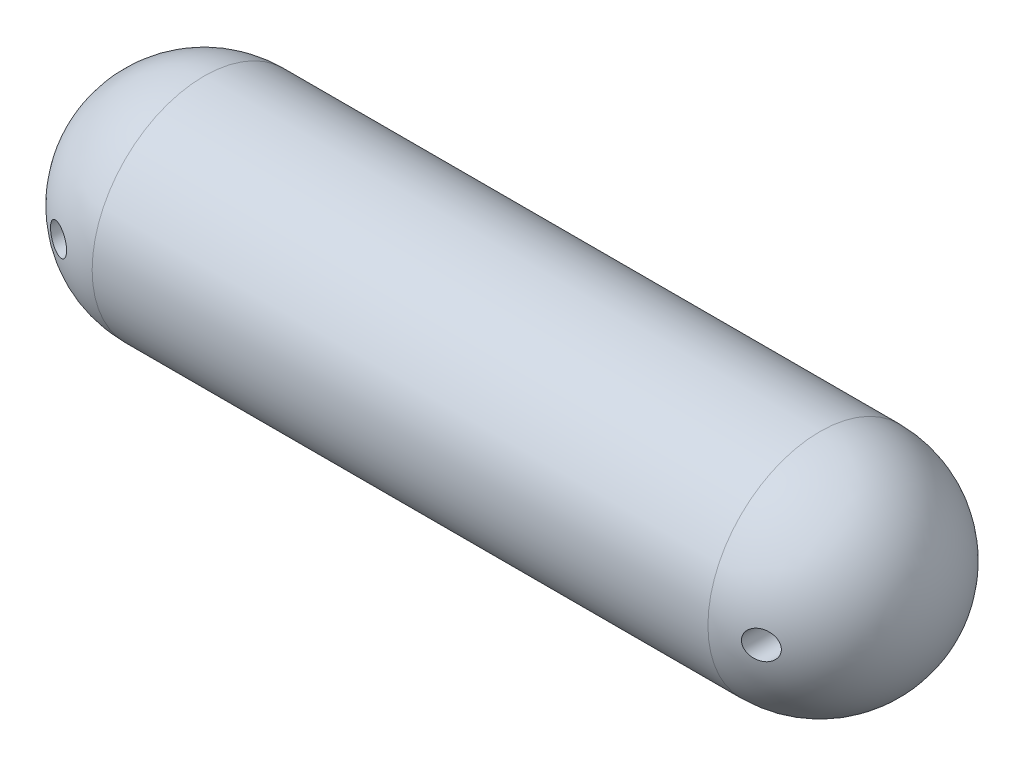
ISO-10303-21;
HEADER;
FILE_DESCRIPTION(('STEP AP214'),'2;1');
FILE_NAME('part.step','',(''),(''),'','','');
FILE_SCHEMA(('AUTOMOTIVE_DESIGN { 1 0 10303 214 1 1 1 1 }'));
ENDSEC;
DATA;
#1=APPLICATION_CONTEXT('core data for automotive mechanical design processes');
#2=APPLICATION_PROTOCOL_DEFINITION('international standard','automotive_design',2000,#1);
#3=PRODUCT_CONTEXT('',#1,'mechanical');
#4=PRODUCT('Part','Part','',(#3));
#5=PRODUCT_RELATED_PRODUCT_CATEGORY('part','',(#4));
#6=PRODUCT_DEFINITION_FORMATION('','',#4);
#7=PRODUCT_DEFINITION_CONTEXT('part definition',#1,'design');
#8=PRODUCT_DEFINITION('design','',#6,#7);
#9=PRODUCT_DEFINITION_SHAPE('','',#8);
#10=(LENGTH_UNIT() NAMED_UNIT(*) SI_UNIT(.MILLI.,.METRE.));
#11=(NAMED_UNIT(*) PLANE_ANGLE_UNIT() SI_UNIT($,.RADIAN.));
#12=(NAMED_UNIT(*) SI_UNIT($,.STERADIAN.) SOLID_ANGLE_UNIT());
#13=UNCERTAINTY_MEASURE_WITH_UNIT(LENGTH_MEASURE(1.E-05),#10,'distance_accuracy_value','');
#14=(GEOMETRIC_REPRESENTATION_CONTEXT(3) GLOBAL_UNCERTAINTY_ASSIGNED_CONTEXT((#13)) GLOBAL_UNIT_ASSIGNED_CONTEXT((#10,
#11,#12)) REPRESENTATION_CONTEXT('',''));
#15=CARTESIAN_POINT('',(0.,0.,0.));
#16=DIRECTION('',(0.,0.,1.));
#17=DIRECTION('',(1.,0.,0.));
#18=AXIS2_PLACEMENT_3D('',#15,#16,#17);
#19=CARTESIAN_POINT('',(17.0807453416149,0.,0.));
#20=DIRECTION('',(-1.,0.,0.));
#21=DIRECTION('',(0.,0.,-1.));
#22=AXIS2_PLACEMENT_3D('',#19,#20,#21);
#23=SPHERICAL_SURFACE('',#22,20.);
#24=CARTESIAN_POINT('',(7.79460655346352,-1.99230699984324,-17.6010891488443));
#25=CARTESIAN_POINT('',(7.91533030538053,-2.08380952371355,-17.6544229268654));
#26=CARTESIAN_POINT('',(8.04365995124297,-2.16376400835696,-17.71087234978));
#27=CARTESIAN_POINT('',(8.31120563862073,-2.29898040794063,-17.8279517079224));
#28=CARTESIAN_POINT('',(8.4504451932171,-2.35418716536529,-17.8885906372037));
#29=CARTESIAN_POINT('',(8.73522617186792,-2.43876323985022,-18.0119551129045));
#30=CARTESIAN_POINT('',(8.88075050281228,-2.46819851307812,-18.0746749038447));
#31=CARTESIAN_POINT('',(9.1744226508665,-2.50096538939297,-18.2005776214291));
#32=CARTESIAN_POINT('',(9.32256938546009,-2.50430752286357,-18.2637603509403));
#33=CARTESIAN_POINT('',(9.6223756258616,-2.48443764411354,-18.3909690205846));
#34=CARTESIAN_POINT('',(9.77399585255528,-2.46037254175409,-18.4549572520982));
#35=CARTESIAN_POINT('',(10.0715001189744,-2.38448121372413,-18.579886983166));
#36=CARTESIAN_POINT('',(10.217383435258,-2.33265149882476,-18.640828098731));
#37=CARTESIAN_POINT('',(10.496211368998,-2.20312770813713,-18.7567762616206));
#38=CARTESIAN_POINT('',(10.629338759897,-2.12590575609882,-18.8118689885273));
#39=CARTESIAN_POINT('',(10.8807794020242,-1.94682111477329,-18.9155172077624));
#40=CARTESIAN_POINT('',(10.999098195504,-1.84496768613979,-18.9640751463095));
#41=CARTESIAN_POINT('',(11.2092453579851,-1.62623933073859,-19.0500419651065));
#42=CARTESIAN_POINT('',(11.3022760519971,-1.51072234174064,-19.0879618282634));
#43=CARTESIAN_POINT('',(11.4672731348825,-1.26326039234458,-19.1550596117576));
#44=CARTESIAN_POINT('',(11.5392511380246,-1.13132454732623,-19.184242352368));
#45=CARTESIAN_POINT('',(11.6541498737888,-0.865942912724311,-19.230755635141));
#46=CARTESIAN_POINT('',(11.6989004676941,-0.733419218899159,-19.2488336366757));
#47=CARTESIAN_POINT('',(11.7657407015413,-0.461887843720156,-19.2758162853889));
#48=CARTESIAN_POINT('',(11.7878393759314,-0.322882770532058,-19.2847245897977));
#49=CARTESIAN_POINT('',(11.8078008301975,-0.0508195176042772,-19.2927715986983));
#50=CARTESIAN_POINT('',(11.806965791017,0.0821293936031812,-19.2924352175527));
#51=CARTESIAN_POINT('',(11.7842972852861,0.345914410315859,-19.2832963621108));
#52=CARTESIAN_POINT('',(11.7624665237958,0.476750785789323,-19.2744949784338));
#53=CARTESIAN_POINT('',(11.6991228223282,0.730885662094999,-19.2489229447746));
#54=CARTESIAN_POINT('',(11.6578717810423,0.854260520298883,-19.232258330428));
#55=CARTESIAN_POINT('',(11.5573536194464,1.09211789740075,-19.1915739543694));
#56=CARTESIAN_POINT('',(11.4980846718743,1.20659951292316,-19.1675534466675));
#57=CARTESIAN_POINT('',(11.361438549868,1.42747149316575,-19.112039271456));
#58=CARTESIAN_POINT('',(11.2835439916699,1.53348720206525,-19.0803316354125));
#59=CARTESIAN_POINT('',(11.1133539344664,1.73094502018716,-19.0108463399338));
#60=CARTESIAN_POINT('',(11.0210548157199,1.82238345455985,-18.9730671546998));
#61=CARTESIAN_POINT('',(10.8185247511426,1.99434562349603,-18.8898851646838));
#62=CARTESIAN_POINT('',(10.7075262747221,2.07380381386169,-18.8441501251574));
#63=CARTESIAN_POINT('',(10.4755893949155,2.21304986785943,-18.7481983986838));
#64=CARTESIAN_POINT('',(10.3546477705175,2.27283132572621,-18.6979802590125));
#65=CARTESIAN_POINT('',(10.0967832023094,2.3755904560324,-18.5904435250398));
#66=CARTESIAN_POINT('',(9.95933964167247,2.41700100264169,-18.5328744445771));
#67=CARTESIAN_POINT('',(9.68034443771659,2.47574523813251,-18.4154430705687));
#68=CARTESIAN_POINT('',(9.53879149449842,2.4930712218545,-18.355580049434));
#69=CARTESIAN_POINT('',(9.24693166321698,2.50383318301577,-18.2315323978607));
#70=CARTESIAN_POINT('',(9.09659133883373,2.49583167453516,-18.1672978468911));
#71=CARTESIAN_POINT('',(8.79939659101112,2.45297937595842,-18.0396447107553));
#72=CARTESIAN_POINT('',(8.65254289472893,2.41812303495821,-17.9762262970406));
#73=CARTESIAN_POINT('',(8.36421829006895,2.32137162631801,-17.85107400715));
#74=CARTESIAN_POINT('',(8.22286730211414,2.25906268885308,-17.7893819206959));
#75=CARTESIAN_POINT('',(7.95252062900798,2.10837586226491,-17.6708153193121));
#76=CARTESIAN_POINT('',(7.82352340351644,2.02000122878754,-17.6139402038767));
#77=CARTESIAN_POINT('',(7.5875531222298,1.82309231595902,-17.5094515269272));
#78=CARTESIAN_POINT('',(7.47989276358602,1.71553591229076,-17.4615533843893));
#79=CARTESIAN_POINT('',(7.28459618626964,1.48055162738279,-17.3743669893714));
#80=CARTESIAN_POINT('',(7.19694795038443,1.35313574945745,-17.3350735703665));
#81=CARTESIAN_POINT('',(7.05221457040599,1.09361522861379,-17.2700239476934));
#82=CARTESIAN_POINT('',(6.9931700677234,0.962820916371059,-17.2434032723883));
#83=CARTESIAN_POINT('',(6.89807294361344,0.691545679589723,-17.2004660031274));
#84=CARTESIAN_POINT('',(6.86200578267497,0.551070943086446,-17.1841428931831));
#85=CARTESIAN_POINT('',(6.81667472863076,0.277174296885228,-17.1636174698269));
#86=CARTESIAN_POINT('',(6.80541994073164,0.144146296361419,-17.1585149386242));
#87=CARTESIAN_POINT('',(6.8042480214304,-0.122000602606263,-17.1579839000721));
#88=CARTESIAN_POINT('',(6.81432427154652,-0.255119460048039,-17.1625523920487));
#89=CARTESIAN_POINT('',(6.85459446404069,-0.512671825142452,-17.1807877722957));
#90=CARTESIAN_POINT('',(6.88405261067243,-0.6372455473732,-17.1941218759786));
#91=CARTESIAN_POINT('',(6.96115286621925,-0.879449724899457,-17.2289545536389));
#92=CARTESIAN_POINT('',(7.00880136066136,-0.997077725211483,-17.2504559946594));
#93=CARTESIAN_POINT('',(7.12202818408189,-1.22563643152107,-17.3014204950242));
#94=CARTESIAN_POINT('',(7.1880627894187,-1.33629465893522,-17.3310859019082));
#95=CARTESIAN_POINT('',(7.33510190030447,-1.5448321790412,-17.3969324759289));
#96=CARTESIAN_POINT('',(7.4160914839686,-1.64272404516502,-17.4331071472949));
#97=CARTESIAN_POINT('',(7.5486869494138,-1.78054247656994,-17.4921193304617));
#98=CARTESIAN_POINT('',(7.59576876269218,-1.8257617268448,-17.5130380782674));
#99=CARTESIAN_POINT('',(7.69297459054838,-1.9121234335518,-17.556145299169));
#100=CARTESIAN_POINT('',(7.74309828083527,-1.95326632333308,-17.5783336369009));
#101=CARTESIAN_POINT('',(7.79460655346352,-1.99230699984324,-17.6010891488443));
#102=B_SPLINE_CURVE_WITH_KNOTS('',3,(#24,#25,#26,#27,#28,#29,#30,#31,#32,#33,#34,#35,#36,#37,
#38,#39,#40,#41,#42,#43,#44,#45,#46,#47,#48,#49,#50,#51,#52,#53,#54,#55,#56,#57,#58,#59,#60,#61,
#62,#63,#64,#65,#66,#67,#68,#69,#70,#71,#72,#73,#74,#75,#76,#77,#78,#79,#80,#81,#82,#83,#84,#85,
#86,#87,#88,#89,#90,#91,#92,#93,#94,#95,#96,#97,#98,#99,#100,#101),.UNSPECIFIED.,.T.,.F.,(4,2,2,
2,2,2,2,2,2,2,2,2,2,2,2,2,2,2,2,2,2,2,2,2,2,2,2,2,2,2,2,2,2,2,2,2,2,2,4),(0.,0.481528440133662,
0.964124834563134,1.44548249389428,1.92664588212467,2.42320533275707,2.91982720155483,
3.40769316920355,3.89537599910971,4.35220665130577,4.80878480348332,5.22971634401624,
5.65047993562234,6.04740461564583,6.4442781632882,6.83594648002709,7.22765453054894,
7.63185927091083,8.03616574845325,8.46621309018428,8.89640029578224,9.3583589883123,
9.82046543718304,10.3092595118775,10.798154647608,11.2946868777165,11.7911571164233,
12.2672218685106,12.742999989011,13.1784960161067,13.6137161973223,14.0125055858677,
14.4111712582844,14.7955136577669,15.1799911007847,15.5750225917173,15.9696620345329,
16.1751339289771,16.3805839566544),.UNSPECIFIED.);
#103=CARTESIAN_POINT('',(7.79460655346352,-1.99230699984324,-17.6010891488443));
#104=VERTEX_POINT('',#103);
#105=EDGE_CURVE('E174',#104,#104,#102,.T.);
#106=ORIENTED_EDGE('',*,*,#105,.T.);
#107=EDGE_LOOP('',(#106));
#108=FACE_BOUND('',#107,.T.);
#109=CARTESIAN_POINT('',(7.30098081316444,-1.49488151866139,17.3816436223168));
#110=CARTESIAN_POINT('',(7.22337638050521,-1.39085164603845,17.3469261996354));
#111=CARTESIAN_POINT('',(7.15333496113271,-1.28002352921363,17.3154878532966));
#112=CARTESIAN_POINT('',(7.030881783956,-1.04716696434497,17.2604099727311));
#113=CARTESIAN_POINT('',(6.97847484564353,-0.925135466004293,17.2367725705309));
#114=CARTESIAN_POINT('',(6.89332840138515,-0.6727076784167,17.1983182687378));
#115=CARTESIAN_POINT('',(6.86063584336044,-0.542292233735111,17.1835224252267));
#116=CARTESIAN_POINT('',(6.8165962100099,-0.277195292874665,17.1635820916353));
#117=CARTESIAN_POINT('',(6.80524365347801,-0.142514901192461,17.1584351232302));
#118=CARTESIAN_POINT('',(6.80441584472076,0.121730097413196,17.1580598795865));
#119=CARTESIAN_POINT('',(6.81411678860817,0.251292442745063,17.1624581095629));
#120=CARTESIAN_POINT('',(6.85329802682881,0.506743567225778,17.180201015894));
#121=CARTESIAN_POINT('',(6.88277763127659,0.632632474345409,17.1935453802049));
#122=CARTESIAN_POINT('',(6.96014546895818,0.876874441109376,17.2284998878819));
#123=CARTESIAN_POINT('',(7.00796834079723,0.995252537745325,17.2500806815593));
#124=CARTESIAN_POINT('',(7.1202191925147,1.22212716210493,17.3006066082174));
#125=CARTESIAN_POINT('',(7.18465018535646,1.33062189199842,17.3295530774304));
#126=CARTESIAN_POINT('',(7.33175848351165,1.54090615232874,17.3954397272747));
#127=CARTESIAN_POINT('',(7.41521966072911,1.64203903957006,17.4327213165348));
#128=CARTESIAN_POINT('',(7.59549633102399,1.82896913189478,17.5129498175123));
#129=CARTESIAN_POINT('',(7.69231629090874,1.91476118530485,17.5558986239798));
#130=CARTESIAN_POINT('',(7.9051446444597,2.07610546601014,17.649923458263));
#131=CARTESIAN_POINT('',(8.02207882463823,2.15021567096047,17.7013782156689));
#132=CARTESIAN_POINT('',(8.26522435704873,2.27774657209871,17.8078680668331));
#133=CARTESIAN_POINT('',(8.39143913281263,2.33115958725302,17.8629044809644));
#134=CARTESIAN_POINT('',(8.66017710259393,2.41991822162986,17.9795227146427));
#135=CARTESIAN_POINT('',(8.80320292298286,2.4535177851443,18.0412793094795));
#136=CARTESIAN_POINT('',(9.0926035490298,2.49526709567858,18.165585306998));
#137=CARTESIAN_POINT('',(9.23897930632218,2.50340951824111,18.2281349326518));
#138=CARTESIAN_POINT('',(9.53739489369429,2.49381263058465,18.3550033225205));
#139=CARTESIAN_POINT('',(9.68941623293872,2.47497927939469,18.419287013175));
#140=CARTESIAN_POINT('',(9.98856686013777,2.40954710428054,18.5451473785362));
#141=CARTESIAN_POINT('',(10.1356959326981,2.36294705956261,18.6067239340927));
#142=CARTESIAN_POINT('',(10.418651843667,2.24335660560506,18.72459847371));
#143=CARTESIAN_POINT('',(10.5545967243175,2.1707024658953,18.7809526975629));
#144=CARTESIAN_POINT('',(10.8124608643019,2.00021254192434,18.8874153295736));
#145=CARTESIAN_POINT('',(10.9343847373159,1.90238507557107,18.9375257927268));
#146=CARTESIAN_POINT('',(11.1525863475973,1.69040071202999,19.0269044207193));
#147=CARTESIAN_POINT('',(11.2499643635464,1.57757687243561,19.066642917146));
#148=CARTESIAN_POINT('',(11.4240467368156,1.33459005932963,19.1375073379399));
#149=CARTESIAN_POINT('',(11.5007624123647,1.20443663708905,19.1686379776904));
#150=CARTESIAN_POINT('',(11.6249351703399,0.941529693227247,19.2189412744377));
#151=CARTESIAN_POINT('',(11.6742129216984,0.809777790947097,19.2388594061452));
#152=CARTESIAN_POINT('',(11.7500823635764,0.538885070796779,19.2694999927326));
#153=CARTESIAN_POINT('',(11.7766836704414,0.399747411604279,19.2802263455582));
#154=CARTESIAN_POINT('',(11.8051150743385,0.127033191317399,19.2916894865719));
#155=CARTESIAN_POINT('',(11.8083342575241,-0.00637687308146695,19.292986460412));
#156=CARTESIAN_POINT('',(11.7935400318278,-0.27180710560012,19.2870228106977));
#157=CARTESIAN_POINT('',(11.7755298666301,-0.403827482944326,19.2797634944799));
#158=CARTESIAN_POINT('',(11.7195270319749,-0.660362773938304,19.257162883824));
#159=CARTESIAN_POINT('',(11.68189096565,-0.784968796393492,19.241965810795));
#160=CARTESIAN_POINT('',(11.5882937768465,-1.02586698074396,19.2041045830771));
#161=CARTESIAN_POINT('',(11.5323311500532,-1.1421584591944,19.1814398154102));
#162=CARTESIAN_POINT('',(11.4022508124355,-1.36676713177667,19.1286349206801));
#163=CARTESIAN_POINT('',(11.3276676453226,-1.47476891923884,19.0983028442663));
#164=CARTESIAN_POINT('',(11.1637314158488,-1.67670421868553,19.0314385477027));
#165=CARTESIAN_POINT('',(11.0743747809454,-1.77063431733463,18.9949048278048));
#166=CARTESIAN_POINT('',(10.8776928431155,-1.94798082659466,18.9142227968165));
#167=CARTESIAN_POINT('',(10.769600440794,-2.03039539268423,18.8697443700677));
#168=CARTESIAN_POINT('',(10.5430063659978,-2.17601120826471,18.7761362366562));
#169=CARTESIAN_POINT('',(10.4245013307583,-2.23920622117894,18.7270050269736));
#170=CARTESIAN_POINT('',(10.1711506494182,-2.34945031909188,18.6215205267051));
#171=CARTESIAN_POINT('',(10.0357447153831,-2.39495889697062,18.5649018439734));
#172=CARTESIAN_POINT('',(9.7602090289254,-2.46226352871077,18.449132504975));
#173=CARTESIAN_POINT('',(9.62007793036234,-2.48405276536986,18.3899811258574));
#174=CARTESIAN_POINT('',(9.33009850522798,-2.50434299401587,18.266967883095));
#175=CARTESIAN_POINT('',(9.18017399509375,-2.50135962621625,18.2030371366029));
#176=CARTESIAN_POINT('',(8.88298550429385,-2.46868887549645,18.0756391209391));
#177=CARTESIAN_POINT('',(8.73572276838454,-2.43898931253636,18.0121720764775));
#178=CARTESIAN_POINT('',(8.44495870416426,-2.35247683350933,17.8862120441134));
#179=CARTESIAN_POINT('',(8.30160091324699,-2.29510866247768,17.8237673558273));
#180=CARTESIAN_POINT('',(8.02653620673347,-2.15403068232008,17.7033583374721));
#181=CARTESIAN_POINT('',(7.89481529788907,-2.07035307793148,17.6453886371603));
#182=CARTESIAN_POINT('',(7.68354796326669,-1.90627011838663,17.5519994487744));
#183=CARTESIAN_POINT('',(7.59995143867895,-1.83195827629053,17.5149169183388));
#184=CARTESIAN_POINT('',(7.44263360166829,-1.67179247240043,17.4449340213938));
#185=CARTESIAN_POINT('',(7.36890984599281,-1.58594137684714,17.4120326202674));
#186=CARTESIAN_POINT('',(7.30098081316444,-1.49488151866139,17.3816436223168));
#187=B_SPLINE_CURVE_WITH_KNOTS('',3,(#109,#110,#111,#112,#113,#114,#115,#116,#117,#118,#119,
#120,#121,#122,#123,#124,#125,#126,#127,#128,#129,#130,#131,#132,#133,#134,#135,#136,#137,#138,
#139,#140,#141,#142,#143,#144,#145,#146,#147,#148,#149,#150,#151,#152,#153,#154,#155,#156,#157,
#158,#159,#160,#161,#162,#163,#164,#165,#166,#167,#168,#169,#170,#171,#172,#173,#174,#175,#176,
#177,#178,#179,#180,#181,#182,#183,#184,#185,#186),.UNSPECIFIED.,.T.,.F.,(4,2,2,2,2,2,2,2,2,2,2,
2,2,2,2,2,2,2,2,2,2,2,2,2,2,2,2,2,2,2,2,2,2,2,2,2,2,2,4),(0.,0.402668922940206,
0.805447805811281,1.20918211882158,1.61281271799193,2.00093515076473,2.3890440464178,
2.77578267599231,3.16259151521956,3.56982690050626,3.97719878552875,4.41840076043136,
4.85976631546152,5.33575605211753,5.81188272661042,6.30787488872714,6.80388885930315,
7.29371869979265,7.78338689540203,8.24365558766866,8.70367164299418,9.12766693509892,
9.55148233496505,9.94989673157047,10.348250261352,10.7396056721212,11.1309932149063,
11.5333653748035,11.9358349796528,12.3630562024092,12.790415907163,13.2493944068365,
13.7085047872321,14.1953145990049,14.6823464622212,15.1795866402452,15.6762205128682,
16.028773748807,16.3812395751533),.UNSPECIFIED.);
#188=CARTESIAN_POINT('',(7.30098081316444,-1.49488151866139,17.3816436223168));
#189=VERTEX_POINT('',#188);
#190=EDGE_CURVE('E228',#189,#189,#187,.T.);
#191=ORIENTED_EDGE('',*,*,#190,.T.);
#192=EDGE_LOOP('',(#191));
#193=FACE_BOUND('',#192,.T.);
#194=CARTESIAN_POINT('',(17.0807453416149,0.,0.));
#195=DIRECTION('',(-1.,0.,0.));
#196=DIRECTION('',(0.,0.,1.));
#197=AXIS2_PLACEMENT_3D('',#194,#195,#196);
#198=CIRCLE('',#197,20.);
#199=CARTESIAN_POINT('',(17.0807453416149,0.,20.));
#200=VERTEX_POINT('',#199);
#201=EDGE_CURVE('E182',#200,#200,#198,.T.);
#202=ORIENTED_EDGE('',*,*,#201,.T.);
#203=EDGE_LOOP('',(#202));
#204=FACE_BOUND('',#203,.T.);
#205=ADVANCED_FACE('F170',(#108,#193,#204),#23,.T.);
#206=CARTESIAN_POINT('',(127.080745341615,0.,0.));
#207=DIRECTION('',(-1.,0.,0.));
#208=DIRECTION('',(0.,0.,1.));
#209=AXIS2_PLACEMENT_3D('',#206,#207,#208);
#210=SPHERICAL_SURFACE('',#209,20.);
#211=CARTESIAN_POINT('',(132.747377249799,-1.34195258750373,-19.1334379051062));
#212=CARTESIAN_POINT('',(132.82454114132,-1.46322538329317,-19.10207804459));
#213=CARTESIAN_POINT('',(132.911796358442,-1.57719211578266,-19.0665400237634));
#214=CARTESIAN_POINT('',(133.103058603836,-1.787483600649,-18.9883770418997));
#215=CARTESIAN_POINT('',(133.207101466467,-1.88376965089503,-18.9457369145123));
#216=CARTESIAN_POINT('',(133.427866815121,-2.05621635233035,-18.8549094727036));
#217=CARTESIAN_POINT('',(133.544541346876,-2.13244959388852,-18.8067430989289));
#218=CARTESIAN_POINT('',(133.787324302197,-2.26396633223115,-18.7060913750704));
#219=CARTESIAN_POINT('',(133.913429680167,-2.31925655766672,-18.6536074187633));
#220=CARTESIAN_POINT('',(134.179387074744,-2.41084865352808,-18.5424183332547));
#221=CARTESIAN_POINT('',(134.31961150373,-2.445845508529,-18.4835288649152));
#222=CARTESIAN_POINT('',(134.603210753147,-2.4912635868489,-18.3638325601233));
#223=CARTESIAN_POINT('',(134.746586787546,-2.50167516658637,-18.3030249807653));
#224=CARTESIAN_POINT('',(135.040555885803,-2.49778629265615,-18.1777158783643));
#225=CARTESIAN_POINT('',(135.191122889896,-2.48212826708386,-18.1131913970012));
#226=CARTESIAN_POINT('',(135.487559149776,-2.42380264207703,-17.9854821466658));
#227=CARTESIAN_POINT('',(135.633427592667,-2.3811303950237,-17.9222976101558));
#228=CARTESIAN_POINT('',(135.917367707407,-2.26901389553082,-17.7986800453934));
#229=CARTESIAN_POINT('',(136.055367720054,-2.19935832825457,-17.7382730542448));
#230=CARTESIAN_POINT('',(136.317764982523,-2.03450777652873,-17.6228704903209));
#231=CARTESIAN_POINT('',(136.442164896422,-1.93931780658823,-17.5678738579411));
#232=CARTESIAN_POINT('',(136.666985647747,-1.73065249136814,-17.4680729420779));
#233=CARTESIAN_POINT('',(136.768281540171,-1.61829879045308,-17.4229017838568));
#234=CARTESIAN_POINT('',(136.950085215649,-1.37501718627345,-17.341572293216));
#235=CARTESIAN_POINT('',(137.030606383894,-1.24410132733013,-17.3054081580793));
#236=CARTESIAN_POINT('',(137.160980251379,-0.979789065097573,-17.2467228066942));
#237=CARTESIAN_POINT('',(137.212904122356,-0.847618438530103,-17.2232828764681));
#238=CARTESIAN_POINT('',(137.293778949529,-0.575082311919494,-17.186731210031));
#239=CARTESIAN_POINT('',(137.322743600707,-0.434721750833159,-17.173613316846));
#240=CARTESIAN_POINT('',(137.354915494278,-0.161838765864784,-17.1590398796037));
#241=CARTESIAN_POINT('',(137.359983311393,-0.0295775400951261,-17.156741932315));
#242=CARTESIAN_POINT('',(137.349202765233,0.233896565596979,-17.1616273158471));
#243=CARTESIAN_POINT('',(137.333358659785,0.365109653456317,-17.1688087166009));
#244=CARTESIAN_POINT('',(137.282175419532,0.619128719058481,-17.191974099871));
#245=CARTESIAN_POINT('',(137.247372224126,0.742065904812129,-17.2077160701418));
#246=CARTESIAN_POINT('',(137.160043798758,0.980101632433345,-17.2471333149682));
#247=CARTESIAN_POINT('',(137.107516676766,1.0951993358588,-17.270809436493));
#248=CARTESIAN_POINT('',(136.984520057915,1.31876644439829,-17.3260997211906));
#249=CARTESIAN_POINT('',(136.913487733468,1.42686369747086,-17.3579623560334));
#250=CARTESIAN_POINT('',(136.756877711955,1.62962567394311,-17.4279784571104));
#251=CARTESIAN_POINT('',(136.671295715218,1.7242864114112,-17.4661337828397));
#252=CARTESIAN_POINT('',(136.481100793385,1.90519519924525,-17.550611641924));
#253=CARTESIAN_POINT('',(136.375534827184,1.99025328103412,-17.5973348956779));
#254=CARTESIAN_POINT('',(136.153526122935,2.14155527591797,-17.6951645986582));
#255=CARTESIAN_POINT('',(136.037079373391,2.20779221343212,-17.7462726638911));
#256=CARTESIAN_POINT('',(135.786116499719,2.32527811632699,-17.855912459236));
#257=CARTESIAN_POINT('',(135.650904370129,2.37479771273748,-17.9147070239995));
#258=CARTESIAN_POINT('',(135.374771846252,2.44991290865048,-18.034165193889));
#259=CARTESIAN_POINT('',(135.233849564612,2.47550052959658,-18.0948294153725));
#260=CARTESIAN_POINT('',(134.94161375922,2.50310665442555,-18.2199916541868));
#261=CARTESIAN_POINT('',(134.790169854991,2.50367992752321,-18.2845089003186));
#262=CARTESIAN_POINT('',(134.489035096291,2.47743513542738,-18.412128657433));
#263=CARTESIAN_POINT('',(134.339344507295,2.45061297507858,-18.4752309554635));
#264=CARTESIAN_POINT('',(134.044995891833,2.36952203748553,-18.5987065987066));
#265=CARTESIAN_POINT('',(133.900382309535,2.31505534421275,-18.6590567966809));
#266=CARTESIAN_POINT('',(133.622047069852,2.17936478528067,-18.7746914110555));
#267=CARTESIAN_POINT('',(133.488323309184,2.09814610191438,-18.8299768059409));
#268=CARTESIAN_POINT('',(133.242442549391,1.91485383895062,-18.9312362177923));
#269=CARTESIAN_POINT('',(133.129579996622,1.81390063581226,-18.9775199524196));
#270=CARTESIAN_POINT('',(132.922672512064,1.59142960575524,-19.0621108192207));
#271=CARTESIAN_POINT('',(132.828618037637,1.46992226543476,-19.1004219968273));
#272=CARTESIAN_POINT('',(132.669790259578,1.21974255971982,-19.1649689363536));
#273=CARTESIAN_POINT('',(132.603333457826,1.09231893908798,-19.1919017235339));
#274=CARTESIAN_POINT('',(132.492909849431,0.826589835236765,-19.2365899764401));
#275=CARTESIAN_POINT('',(132.448930730577,0.688290357305246,-19.254350466372));
#276=CARTESIAN_POINT('',(132.387725952145,0.415268570831529,-19.2790518074615));
#277=CARTESIAN_POINT('',(132.368837345046,0.280977911812405,-19.2866653143561));
#278=CARTESIAN_POINT('',(132.353049837654,0.0108691137319333,-19.2930294889248));
#279=CARTESIAN_POINT('',(132.356152031486,-0.124949100995284,-19.2917797156181));
#280=CARTESIAN_POINT('',(132.383733717221,-0.38939378054652,-19.2806590001655));
#281=CARTESIAN_POINT('',(132.407495490916,-0.518108914142576,-19.2710775024029));
#282=CARTESIAN_POINT('',(132.474468086582,-0.769363437135631,-19.2440348038335));
#283=CARTESIAN_POINT('',(132.517651857671,-0.891911153419295,-19.2265845624938));
#284=CARTESIAN_POINT('',(132.595194184659,-1.06755961998291,-19.1951890378081));
#285=CARTESIAN_POINT('',(132.622836659263,-1.12422755839437,-19.1839888821248));
#286=CARTESIAN_POINT('',(132.682142057768,-1.23504200886483,-19.1599352985343));
#287=CARTESIAN_POINT('',(132.713804522137,-1.28918880815488,-19.1470820595921));
#288=CARTESIAN_POINT('',(132.747377249799,-1.34195258750373,-19.1334379051062));
#289=B_SPLINE_CURVE_WITH_KNOTS('',3,(#211,#212,#213,#214,#215,#216,#217,#218,#219,#220,#221,
#222,#223,#224,#225,#226,#227,#228,#229,#230,#231,#232,#233,#234,#235,#236,#237,#238,#239,#240,
#241,#242,#243,#244,#245,#246,#247,#248,#249,#250,#251,#252,#253,#254,#255,#256,#257,#258,#259,
#260,#261,#262,#263,#264,#265,#266,#267,#268,#269,#270,#271,#272,#273,#274,#275,#276,#277,#278,
#279,#280,#281,#282,#283,#284,#285,#286,#287,#288),.UNSPECIFIED.,.T.,.F.,(4,2,2,2,2,2,2,2,2,2,2,
2,2,2,2,2,2,2,2,2,2,2,2,2,2,2,2,2,2,2,2,2,2,2,2,2,2,2,4),(0.,0.441112074328708,
0.883178500932246,1.32362192860038,1.76392372867596,2.2300692745537,2.69639763580897,
3.18777707238443,3.67924107053671,4.17463432834087,4.66993037072577,5.14100876459025,
5.61178287957185,6.04124566609471,6.47045208850027,6.86561927531061,7.26070601550094,
7.64516379318645,8.02966262473979,8.42759709311681,8.82564936282665,9.2540206639671,
9.68255052362154,10.1471262919635,10.6118568876463,11.1034042631383,11.5950251274291,
12.0902163824113,12.5853117672018,13.05782186329,13.5300916106433,13.966425093801,
14.4025193173025,14.8079661209657,15.2134330972451,15.605352671886,15.996728064857,
16.1886705240102,16.3805910615593),.UNSPECIFIED.);
#290=CARTESIAN_POINT('',(132.747377249799,-1.34195258750373,-19.1334379051062));
#291=VERTEX_POINT('',#290);
#292=EDGE_CURVE('E196',#291,#291,#289,.T.);
#293=ORIENTED_EDGE('',*,*,#292,.T.);
#294=EDGE_LOOP('',(#293));
#295=FACE_BOUND('',#294,.T.);
#296=CARTESIAN_POINT('',(132.911958594124,-1.57100411723496,19.0664337970597));
#297=CARTESIAN_POINT('',(132.829215287364,-1.46857214241968,19.1001793666177));
#298=CARTESIAN_POINT('',(132.754033855284,-1.35891006934775,19.1307512591204));
#299=CARTESIAN_POINT('',(132.621441167181,-1.12760007507861,19.1845697318763));
#300=CARTESIAN_POINT('',(132.564037629517,-1.00594697805121,19.2078131305071));
#301=CARTESIAN_POINT('',(132.469155196448,-0.753601928584014,19.2461864041341));
#302=CARTESIAN_POINT('',(132.431713442276,-0.62289363471802,19.261301155284));
#303=CARTESIAN_POINT('',(132.378498681188,-0.35645150877349,19.2827725117601));
#304=CARTESIAN_POINT('',(132.36272058523,-0.220718864669313,19.2891311739935));
#305=CARTESIAN_POINT('',(132.35365123957,0.0472146610049497,19.2927868630794));
#306=CARTESIAN_POINT('',(132.359650627793,0.179388132353169,19.2903697445622));
#307=CARTESIAN_POINT('',(132.392313906267,0.440717303446539,19.2771986637733));
#308=CARTESIAN_POINT('',(132.418976538242,0.569873186452885,19.2664452091386));
#309=CARTESIAN_POINT('',(132.491638921514,0.820674238576298,19.2370961241363));
#310=CARTESIAN_POINT('',(132.537502820539,0.942365418306503,19.2185555858216));
#311=CARTESIAN_POINT('',(132.646841075111,1.17612247758521,19.1742655676672));
#312=CARTESIAN_POINT('',(132.710317537655,1.28818720341541,19.1485152253125));
#313=CARTESIAN_POINT('',(132.855337486759,1.50404219547029,19.0895353717958));
#314=CARTESIAN_POINT('',(132.937458108091,1.60737837815343,19.0560662369281));
#315=CARTESIAN_POINT('',(133.115614017134,1.79883282625509,18.9832294461219));
#316=CARTESIAN_POINT('',(133.21165298114,1.88694705753131,18.9438602316831));
#317=CARTESIAN_POINT('',(133.42159196965,2.05170101424093,18.8574952522223));
#318=CARTESIAN_POINT('',(133.536253370906,2.12719560333807,18.8101672086637));
#319=CARTESIAN_POINT('',(133.774893441181,2.25793381951832,18.7112557875012));
#320=CARTESIAN_POINT('',(133.898875165917,2.31317076983012,18.6596710137598));
#321=CARTESIAN_POINT('',(134.162288879434,2.40597502684462,18.5495866299929));
#322=CARTESIAN_POINT('',(134.302187064285,2.44194878141592,18.4908573618059));
#323=CARTESIAN_POINT('',(134.585267757346,2.48936712856844,18.3714282917676));
#324=CARTESIAN_POINT('',(134.728451279674,2.50080404130715,18.3107278789959));
#325=CARTESIAN_POINT('',(135.022213759358,2.49906268255906,18.185560215277));
#326=CARTESIAN_POINT('',(135.172775018157,2.4845233519854,18.1210663946753));
#327=CARTESIAN_POINT('',(135.46937813114,2.42845413962402,17.9933409360808));
#328=CARTESIAN_POINT('',(135.615419162456,2.38691937347887,17.9301095286342));
#329=CARTESIAN_POINT('',(135.900059212312,2.27702531180086,17.8062407792209));
#330=CARTESIAN_POINT('',(136.038578147155,2.20842466183204,17.7456323787157));
#331=CARTESIAN_POINT('',(136.302193331249,2.04559952553483,17.6297408065242));
#332=CARTESIAN_POINT('',(136.427292024846,1.95137971653526,17.5744566652724));
#333=CARTESIAN_POINT('',(136.653782282384,1.74437094559381,17.4739504892535));
#334=CARTESIAN_POINT('',(136.756021010667,1.6326843830122,17.4283738849619));
#335=CARTESIAN_POINT('',(136.93981453478,1.39054370460579,17.3461780581285));
#336=CARTESIAN_POINT('',(137.021382572032,1.26010168770298,17.3095531017942));
#337=CARTESIAN_POINT('',(137.15384886941,0.996423129043633,17.2499385336997));
#338=CARTESIAN_POINT('',(137.206803997176,0.864426320724264,17.2260372230919));
#339=CARTESIAN_POINT('',(137.289732748198,0.59202267274167,17.1885622685504));
#340=CARTESIAN_POINT('',(137.319720208866,0.451620951880901,17.1749824062552));
#341=CARTESIAN_POINT('',(137.353783910818,0.178555998625682,17.1595528436796));
#342=CARTESIAN_POINT('',(137.359741359683,0.0461724184486616,17.1568515375428));
#343=CARTESIAN_POINT('',(137.350677720291,-0.217709614724009,17.1609589525664));
#344=CARTESIAN_POINT('',(137.335661063661,-0.34920824880198,17.1677656647737));
#345=CARTESIAN_POINT('',(137.286048381531,-0.603757058040745,17.1902220349935));
#346=CARTESIAN_POINT('',(137.252016679692,-0.726940919057855,17.2056167989203));
#347=CARTESIAN_POINT('',(137.166165573357,-0.96559285965666,17.2443726943923));
#348=CARTESIAN_POINT('',(137.114344375113,-1.0810601597602,17.2677346292805));
#349=CARTESIAN_POINT('',(136.992768544629,-1.30535449024206,17.322396873854));
#350=CARTESIAN_POINT('',(136.922466872082,-1.41382507208638,17.3539388519145));
#351=CARTESIAN_POINT('',(136.767250715047,-1.617445256762,17.4233490556267));
#352=CARTESIAN_POINT('',(136.682331930806,-1.71259092497293,17.461219142652));
#353=CARTESIAN_POINT('',(136.493482800922,-1.89455681419954,17.5451240752208));
#354=CARTESIAN_POINT('',(136.388600327546,-1.98020312126,17.5915598124228));
#355=CARTESIAN_POINT('',(136.167871269512,-2.13279218297687,17.6888589326013));
#356=CARTESIAN_POINT('',(136.052020620656,-2.19972796795213,17.7397239562613));
#357=CARTESIAN_POINT('',(135.802173459971,-2.3187854985714,17.8489178439412));
#358=CARTESIAN_POINT('',(135.667470586817,-2.36918192646522,17.9075144031184));
#359=CARTESIAN_POINT('',(135.392233093354,-2.44614415718433,18.0266341499849));
#360=CARTESIAN_POINT('',(135.25169674802,-2.47270285762948,18.0871579063186));
#361=CARTESIAN_POINT('',(134.960004783061,-2.50240784555211,18.2121407878249));
#362=CARTESIAN_POINT('',(134.808708530642,-2.50409523874577,18.2766231968906));
#363=CARTESIAN_POINT('',(134.507651734343,-2.48011876855208,18.404264724479));
#364=CARTESIAN_POINT('',(134.35789182641,-2.45444400638563,18.467423305479));
#365=CARTESIAN_POINT('',(134.062980390775,-2.37561509419339,18.5911866198301));
#366=CARTESIAN_POINT('',(133.917881746105,-2.32221838915158,18.6517636181292));
#367=CARTESIAN_POINT('',(133.638529713723,-2.1886088730427,18.7678640518393));
#368=CARTESIAN_POINT('',(133.504261511442,-2.10843349119589,18.8233944040217));
#369=CARTESIAN_POINT('',(133.291936622972,-1.95268018998886,18.9108643604927));
#370=CARTESIAN_POINT('',(133.209639746897,-1.88383857573139,18.9446673266989));
#371=CARTESIAN_POINT('',(133.05382890776,-1.73530950436715,19.0085129929487));
#372=CARTESIAN_POINT('',(132.980313438306,-1.65562391250271,19.038556337972));
#373=CARTESIAN_POINT('',(132.911958594124,-1.57100411723496,19.0664337970597));
#374=B_SPLINE_CURVE_WITH_KNOTS('',3,(#296,#297,#298,#299,#300,#301,#302,#303,#304,#305,#306,
#307,#308,#309,#310,#311,#312,#313,#314,#315,#316,#317,#318,#319,#320,#321,#322,#323,#324,#325,
#326,#327,#328,#329,#330,#331,#332,#333,#334,#335,#336,#337,#338,#339,#340,#341,#342,#343,#344,
#345,#346,#347,#348,#349,#350,#351,#352,#353,#354,#355,#356,#357,#358,#359,#360,#361,#362,#363,
#364,#365,#366,#367,#368,#369,#370,#371,#372,#373),.UNSPECIFIED.,.T.,.F.,(4,2,2,2,2,2,2,2,2,2,2,
2,2,2,2,2,2,2,2,2,2,2,2,2,2,2,2,2,2,2,2,2,2,2,2,2,2,2,4),(0.,0.407422267545459,
0.815021172276037,1.22337583886763,1.63163456181895,2.02671607325044,2.42177352828352,
2.8140818977627,3.20643721949405,3.61317942380845,4.02002925867554,4.45380145258729,
4.88771648646469,5.35346418305081,5.81935763382476,6.3103820997611,6.80149543282819,
7.29709091029513,7.7925959668252,8.26442456696721,8.73595015036346,9.16628140985767,
9.59635320178237,9.9920145697691,10.3875923509387,10.7720101208456,11.1564666636909,
11.5539203114245,11.9514910741208,12.3791307606243,12.8069295315428,13.2708051088067,
13.7348188505862,14.2259490077837,14.717274863029,15.2129739213396,15.7079830081844,
16.0446153203874,16.3811898024219),.UNSPECIFIED.);
#375=CARTESIAN_POINT('',(132.911958594124,-1.57100411723496,19.0664337970597));
#376=VERTEX_POINT('',#375);
#377=EDGE_CURVE('E189',#376,#376,#374,.T.);
#378=ORIENTED_EDGE('',*,*,#377,.T.);
#379=EDGE_LOOP('',(#378));
#380=FACE_BOUND('',#379,.T.);
#381=CARTESIAN_POINT('',(127.080745341615,0.,0.));
#382=DIRECTION('',(-1.,0.,0.));
#383=DIRECTION('',(0.,0.,1.));
#384=AXIS2_PLACEMENT_3D('',#381,#382,#383);
#385=CIRCLE('',#384,20.);
#386=CARTESIAN_POINT('',(127.080745341615,0.,20.));
#387=VERTEX_POINT('',#386);
#388=EDGE_CURVE('E12',#387,#387,#385,.T.);
#389=ORIENTED_EDGE('',*,*,#388,.F.);
#390=EDGE_LOOP('',(#389));
#391=FACE_BOUND('',#390,.T.);
#392=ADVANCED_FACE('F200',(#295,#380,#391),#210,.T.);
#393=CARTESIAN_POINT('',(-63.0852809193508,0.,0.));
#394=DIRECTION('',(-1.,0.,0.));
#395=DIRECTION('',(0.,0.,1.));
#396=AXIS2_PLACEMENT_3D('',#393,#394,#395);
#397=CYLINDRICAL_SURFACE('',#396,20.);
#398=ORIENTED_EDGE('',*,*,#201,.F.);
#399=EDGE_LOOP('',(#398));
#400=FACE_BOUND('',#399,.T.);
#401=ORIENTED_EDGE('',*,*,#388,.T.);
#402=EDGE_LOOP('',(#401));
#403=FACE_BOUND('',#402,.T.);
#404=ADVANCED_FACE('F207',(#400,#403),#397,.T.);
#405=CARTESIAN_POINT('',(134.856681223407,0.,-20.));
#406=DIRECTION('',(0.,0.,1.));
#407=DIRECTION('',(1.,0.,0.));
#408=AXIS2_PLACEMENT_3D('',#405,#406,#407);
#409=CYLINDRICAL_SURFACE('',#408,2.5);
#410=ORIENTED_EDGE('',*,*,#377,.F.);
#411=EDGE_LOOP('',(#410));
#412=FACE_BOUND('',#411,.T.);
#413=ORIENTED_EDGE('',*,*,#292,.F.);
#414=EDGE_LOOP('',(#413));
#415=FACE_BOUND('',#414,.T.);
#416=ADVANCED_FACE('F203',(#412,#415),#409,.F.);
#417=CARTESIAN_POINT('',(9.30480945982267,0.,-20.));
#418=DIRECTION('',(0.,0.,1.));
#419=DIRECTION('',(1.,0.,0.));
#420=AXIS2_PLACEMENT_3D('',#417,#418,#419);
#421=CYLINDRICAL_SURFACE('',#420,2.5);
#422=ORIENTED_EDGE('',*,*,#190,.F.);
#423=EDGE_LOOP('',(#422));
#424=FACE_BOUND('',#423,.T.);
#425=ORIENTED_EDGE('',*,*,#105,.F.);
#426=EDGE_LOOP('',(#425));
#427=FACE_BOUND('',#426,.T.);
#428=ADVANCED_FACE('F206',(#424,#427),#421,.F.);
#429=CLOSED_SHELL('',(#205,#392,#404,#416,#428));
#430=MANIFOLD_SOLID_BREP('B2',#429);
#431=ADVANCED_BREP_SHAPE_REPRESENTATION('',(#18,#430),#14);
#432=SHAPE_DEFINITION_REPRESENTATION(#9,#431);
ENDSEC;
END-ISO-10303-21;
